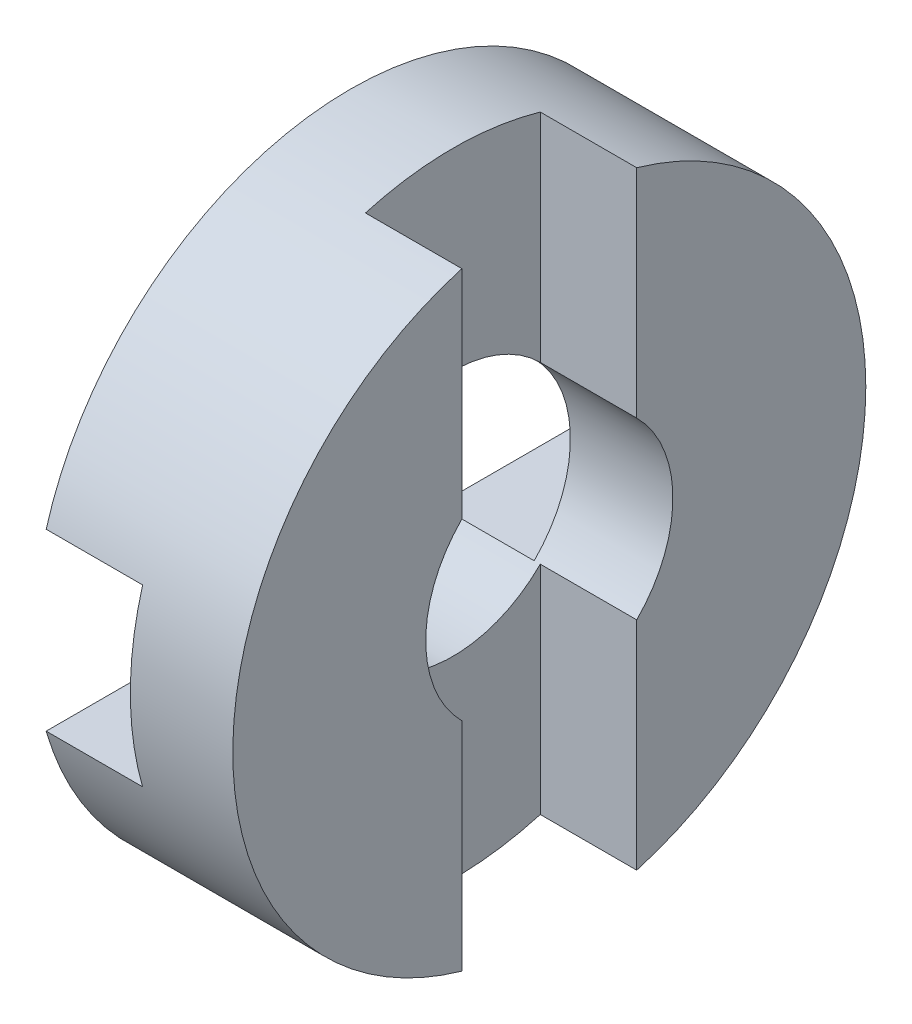
ISO-10303-21;
HEADER;
FILE_DESCRIPTION(('STEP AP214'),'2;1');
FILE_NAME('part.step','',(''),(''),'','','');
FILE_SCHEMA(('AUTOMOTIVE_DESIGN { 1 0 10303 214 1 1 1 1 }'));
ENDSEC;
DATA;
#1=APPLICATION_CONTEXT('core data for automotive mechanical design processes');
#2=APPLICATION_PROTOCOL_DEFINITION('international standard','automotive_design',2000,#1);
#3=PRODUCT_CONTEXT('',#1,'mechanical');
#4=PRODUCT('Part','Part','',(#3));
#5=PRODUCT_RELATED_PRODUCT_CATEGORY('part','',(#4));
#6=PRODUCT_DEFINITION_FORMATION('','',#4);
#7=PRODUCT_DEFINITION_CONTEXT('part definition',#1,'design');
#8=PRODUCT_DEFINITION('design','',#6,#7);
#9=PRODUCT_DEFINITION_SHAPE('','',#8);
#10=(LENGTH_UNIT() NAMED_UNIT(*) SI_UNIT(.MILLI.,.METRE.));
#11=(NAMED_UNIT(*) PLANE_ANGLE_UNIT() SI_UNIT($,.RADIAN.));
#12=(NAMED_UNIT(*) SI_UNIT($,.STERADIAN.) SOLID_ANGLE_UNIT());
#13=UNCERTAINTY_MEASURE_WITH_UNIT(LENGTH_MEASURE(1.E-05),#10,'distance_accuracy_value','');
#14=(GEOMETRIC_REPRESENTATION_CONTEXT(3) GLOBAL_UNCERTAINTY_ASSIGNED_CONTEXT((#13)) GLOBAL_UNIT_ASSIGNED_CONTEXT((#10,
#11,#12)) REPRESENTATION_CONTEXT('',''));
#15=CARTESIAN_POINT('',(0.,0.,0.));
#16=DIRECTION('',(0.,0.,1.));
#17=DIRECTION('',(1.,0.,0.));
#18=AXIS2_PLACEMENT_3D('',#15,#16,#17);
#19=CARTESIAN_POINT('',(-3.3,0.,-7.3));
#20=DIRECTION('',(-1.,0.,0.));
#21=DIRECTION('',(0.,0.,1.));
#22=AXIS2_PLACEMENT_3D('',#19,#20,#21);
#23=PLANE('',#22);
#24=DIRECTION('',(0.,0.,1.));
#25=VECTOR('',#24,1.);
#26=CARTESIAN_POINT('',(-3.3,2.9,-10.5));
#27=LINE('',#26,#25);
#28=CARTESIAN_POINT('',(-3.3,2.9,-10.0915806492343));
#29=VERTEX_POINT('',#28);
#30=CARTESIAN_POINT('',(-3.3,2.9,-2.89827534923789));
#31=VERTEX_POINT('',#30);
#32=EDGE_CURVE('E127',#29,#31,#27,.T.);
#33=ORIENTED_EDGE('',*,*,#32,.T.);
#34=CARTESIAN_POINT('',(-3.3,0.,0.));
#35=DIRECTION('',(-1.,0.,0.));
#36=DIRECTION('',(0.,0.,1.));
#37=AXIS2_PLACEMENT_3D('',#34,#35,#36);
#38=CIRCLE('',#37,4.1);
#39=CARTESIAN_POINT('',(-3.3,2.9,2.89827534923789));
#40=VERTEX_POINT('',#39);
#41=EDGE_CURVE('E20',#31,#40,#38,.F.);
#42=ORIENTED_EDGE('',*,*,#41,.T.);
#43=DIRECTION('',(0.,0.,1.));
#44=VECTOR('',#43,1.);
#45=CARTESIAN_POINT('',(-3.3,2.9,-10.5));
#46=LINE('',#45,#44);
#47=CARTESIAN_POINT('',(-3.3,2.9,10.0915806492343));
#48=VERTEX_POINT('',#47);
#49=EDGE_CURVE('E131',#40,#48,#46,.T.);
#50=ORIENTED_EDGE('',*,*,#49,.T.);
#51=CARTESIAN_POINT('',(-3.3,0.,0.));
#52=DIRECTION('',(-1.,0.,0.));
#53=DIRECTION('',(0.,0.,1.));
#54=AXIS2_PLACEMENT_3D('',#51,#52,#53);
#55=CIRCLE('',#54,10.5);
#56=EDGE_CURVE('E211',#29,#48,#55,.F.);
#57=ORIENTED_EDGE('',*,*,#56,.F.);
#58=EDGE_LOOP('',(#33,#42,#50,#57));
#59=FACE_BOUND('',#58,.T.);
#60=ADVANCED_FACE('F17',(#59),#23,.T.);
#61=CARTESIAN_POINT('',(3.3,-10.5,2.9));
#62=DIRECTION('',(0.,0.,1.));
#63=DIRECTION('',(1.,0.,0.));
#64=AXIS2_PLACEMENT_3D('',#61,#62,#63);
#65=PLANE('',#64);
#66=DIRECTION('',(0.,1.,0.));
#67=VECTOR('',#66,1.);
#68=CARTESIAN_POINT('',(0.0999999999999996,-10.5,2.9));
#69=LINE('',#68,#67);
#70=CARTESIAN_POINT('',(0.0999999999999996,2.89827534923789,2.9));
#71=VERTEX_POINT('',#70);
#72=CARTESIAN_POINT('',(0.0999999999999996,10.0915806492343,2.9));
#73=VERTEX_POINT('',#72);
#74=EDGE_CURVE('E163',#71,#73,#69,.T.);
#75=ORIENTED_EDGE('',*,*,#74,.T.);
#76=DIRECTION('',(-1.,0.,0.));
#77=VECTOR('',#76,1.);
#78=CARTESIAN_POINT('',(0.,10.0915806492343,2.9));
#79=LINE('',#78,#77);
#80=CARTESIAN_POINT('',(3.3,10.0915806492343,2.9));
#81=VERTEX_POINT('',#80);
#82=EDGE_CURVE('E165',#81,#73,#79,.T.);
#83=ORIENTED_EDGE('',*,*,#82,.F.);
#84=DIRECTION('',(0.,1.,0.));
#85=VECTOR('',#84,1.);
#86=CARTESIAN_POINT('',(3.3,0.,2.9));
#87=LINE('',#86,#85);
#88=CARTESIAN_POINT('',(3.3,2.89827534923789,2.9));
#89=VERTEX_POINT('',#88);
#90=EDGE_CURVE('E172',#89,#81,#87,.T.);
#91=ORIENTED_EDGE('',*,*,#90,.F.);
#92=DIRECTION('',(-1.,0.,0.));
#93=VECTOR('',#92,1.);
#94=CARTESIAN_POINT('',(0.,2.89827534923789,2.9));
#95=LINE('',#94,#93);
#96=EDGE_CURVE('E151',#89,#71,#95,.T.);
#97=ORIENTED_EDGE('',*,*,#96,.T.);
#98=EDGE_LOOP('',(#75,#83,#91,#97));
#99=FACE_BOUND('',#98,.T.);
#100=ADVANCED_FACE('F284',(#99),#65,.F.);
#101=CARTESIAN_POINT('',(0.0999999999999996,-10.5,2.9));
#102=DIRECTION('',(-1.,0.,0.));
#103=DIRECTION('',(0.,0.,1.));
#104=AXIS2_PLACEMENT_3D('',#101,#102,#103);
#105=PLANE('',#104);
#106=DIRECTION('',(0.,1.,0.));
#107=VECTOR('',#106,1.);
#108=CARTESIAN_POINT('',(0.0999999999999996,-10.5,-2.9));
#109=LINE('',#108,#107);
#110=CARTESIAN_POINT('',(0.0999999999999996,2.89827534923789,-2.9));
#111=VERTEX_POINT('',#110);
#112=CARTESIAN_POINT('',(0.0999999999999996,10.0915806492343,-2.9));
#113=VERTEX_POINT('',#112);
#114=EDGE_CURVE('E145',#111,#113,#109,.T.);
#115=ORIENTED_EDGE('',*,*,#114,.T.);
#116=CARTESIAN_POINT('',(0.0999999999999996,0.,0.));
#117=DIRECTION('',(-1.,0.,0.));
#118=DIRECTION('',(0.,0.,1.));
#119=AXIS2_PLACEMENT_3D('',#116,#117,#118);
#120=CIRCLE('',#119,10.5);
#121=EDGE_CURVE('E161',#73,#113,#120,.T.);
#122=ORIENTED_EDGE('',*,*,#121,.F.);
#123=ORIENTED_EDGE('',*,*,#74,.F.);
#124=CARTESIAN_POINT('',(0.0999999999999996,0.,0.));
#125=DIRECTION('',(-1.,0.,0.));
#126=DIRECTION('',(0.,0.,1.));
#127=AXIS2_PLACEMENT_3D('',#124,#125,#126);
#128=CIRCLE('',#127,4.1);
#129=EDGE_CURVE('E153',#71,#111,#128,.T.);
#130=ORIENTED_EDGE('',*,*,#129,.T.);
#131=EDGE_LOOP('',(#115,#122,#123,#130));
#132=FACE_BOUND('',#131,.T.);
#133=ADVANCED_FACE('F226',(#132),#105,.F.);
#134=CARTESIAN_POINT('',(0.0999999999999996,-10.5,-2.9));
#135=DIRECTION('',(0.,0.,-1.));
#136=DIRECTION('',(-1.,0.,0.));
#137=AXIS2_PLACEMENT_3D('',#134,#135,#136);
#138=PLANE('',#137);
#139=DIRECTION('',(0.,1.,0.));
#140=VECTOR('',#139,1.);
#141=CARTESIAN_POINT('',(3.3,0.,-2.9));
#142=LINE('',#141,#140);
#143=CARTESIAN_POINT('',(3.3,10.0915806492343,-2.9));
#144=VERTEX_POINT('',#143);
#145=CARTESIAN_POINT('',(3.3,2.89827534923789,-2.9));
#146=VERTEX_POINT('',#145);
#147=EDGE_CURVE('E181',#144,#146,#142,.F.);
#148=ORIENTED_EDGE('',*,*,#147,.F.);
#149=DIRECTION('',(-1.,0.,0.));
#150=VECTOR('',#149,1.);
#151=CARTESIAN_POINT('',(0.,10.0915806492343,-2.9));
#152=LINE('',#151,#150);
#153=EDGE_CURVE('E158',#113,#144,#152,.F.);
#154=ORIENTED_EDGE('',*,*,#153,.F.);
#155=ORIENTED_EDGE('',*,*,#114,.F.);
#156=DIRECTION('',(-1.,0.,0.));
#157=VECTOR('',#156,1.);
#158=CARTESIAN_POINT('',(0.,2.89827534923789,-2.9));
#159=LINE('',#158,#157);
#160=EDGE_CURVE('E179',#111,#146,#159,.F.);
#161=ORIENTED_EDGE('',*,*,#160,.T.);
#162=EDGE_LOOP('',(#148,#154,#155,#161));
#163=FACE_BOUND('',#162,.T.);
#164=ADVANCED_FACE('F234',(#163),#138,.F.);
#165=CARTESIAN_POINT('',(-3.3,2.9,-10.5));
#166=DIRECTION('',(0.,1.,0.));
#167=DIRECTION('',(0.,0.,1.));
#168=AXIS2_PLACEMENT_3D('',#165,#166,#167);
#169=PLANE('',#168);
#170=ORIENTED_EDGE('',*,*,#49,.F.);
#171=DIRECTION('',(-1.,0.,0.));
#172=VECTOR('',#171,1.);
#173=CARTESIAN_POINT('',(0.,2.9,2.89827534923789));
#174=LINE('',#173,#172);
#175=CARTESIAN_POINT('',(-0.0999999999999996,2.9,2.89827534923789));
#176=VERTEX_POINT('',#175);
#177=EDGE_CURVE('E136',#40,#176,#174,.F.);
#178=ORIENTED_EDGE('',*,*,#177,.T.);
#179=DIRECTION('',(0.,0.,-1.));
#180=VECTOR('',#179,1.);
#181=CARTESIAN_POINT('',(-0.0999999999999996,2.9,-10.5));
#182=LINE('',#181,#180);
#183=CARTESIAN_POINT('',(-0.0999999999999996,2.9,10.0915806492343));
#184=VERTEX_POINT('',#183);
#185=EDGE_CURVE('E208',#176,#184,#182,.F.);
#186=ORIENTED_EDGE('',*,*,#185,.T.);
#187=DIRECTION('',(-1.,0.,0.));
#188=VECTOR('',#187,1.);
#189=CARTESIAN_POINT('',(0.,2.9,10.0915806492343));
#190=LINE('',#189,#188);
#191=EDGE_CURVE('E143',#48,#184,#190,.F.);
#192=ORIENTED_EDGE('',*,*,#191,.F.);
#193=EDGE_LOOP('',(#170,#178,#186,#192));
#194=FACE_BOUND('',#193,.T.);
#195=ADVANCED_FACE('F139',(#194),#169,.F.);
#196=CARTESIAN_POINT('',(-3.3,2.9,-10.5));
#197=DIRECTION('',(0.,1.,0.));
#198=DIRECTION('',(0.,0.,1.));
#199=AXIS2_PLACEMENT_3D('',#196,#197,#198);
#200=PLANE('',#199);
#201=ORIENTED_EDGE('',*,*,#32,.F.);
#202=DIRECTION('',(-1.,0.,0.));
#203=VECTOR('',#202,1.);
#204=CARTESIAN_POINT('',(0.,2.9,-10.0915806492343));
#205=LINE('',#204,#203);
#206=CARTESIAN_POINT('',(-0.0999999999999996,2.9,-10.0915806492343));
#207=VERTEX_POINT('',#206);
#208=EDGE_CURVE('E213',#207,#29,#205,.T.);
#209=ORIENTED_EDGE('',*,*,#208,.F.);
#210=DIRECTION('',(0.,0.,-1.));
#211=VECTOR('',#210,1.);
#212=CARTESIAN_POINT('',(-0.0999999999999996,2.9,-10.5));
#213=LINE('',#212,#211);
#214=CARTESIAN_POINT('',(-0.0999999999999996,2.9,-2.89827534923789));
#215=VERTEX_POINT('',#214);
#216=EDGE_CURVE('E202',#207,#215,#213,.F.);
#217=ORIENTED_EDGE('',*,*,#216,.T.);
#218=DIRECTION('',(-1.,0.,0.));
#219=VECTOR('',#218,1.);
#220=CARTESIAN_POINT('',(0.,2.9,-2.89827534923789));
#221=LINE('',#220,#219);
#222=EDGE_CURVE('E137',#215,#31,#221,.T.);
#223=ORIENTED_EDGE('',*,*,#222,.T.);
#224=EDGE_LOOP('',(#201,#209,#217,#223));
#225=FACE_BOUND('',#224,.T.);
#226=ADVANCED_FACE('F328',(#225),#200,.F.);
#227=CARTESIAN_POINT('',(0.,0.,0.));
#228=DIRECTION('',(-1.,0.,0.));
#229=DIRECTION('',(0.,0.,1.));
#230=AXIS2_PLACEMENT_3D('',#227,#228,#229);
#231=CYLINDRICAL_SURFACE('',#230,4.1);
#232=CARTESIAN_POINT('',(3.3,0.,0.));
#233=DIRECTION('',(-1.,0.,0.));
#234=DIRECTION('',(0.,0.,1.));
#235=AXIS2_PLACEMENT_3D('',#232,#233,#234);
#236=CIRCLE('',#235,4.1);
#237=CARTESIAN_POINT('',(3.3,-2.89827534923789,2.9));
#238=VERTEX_POINT('',#237);
#239=EDGE_CURVE('E214',#238,#89,#236,.T.);
#240=ORIENTED_EDGE('',*,*,#239,.F.);
#241=DIRECTION('',(1.,0.,0.));
#242=VECTOR('',#241,1.);
#243=CARTESIAN_POINT('',(3.3,-2.89827534923789,2.9));
#244=LINE('',#243,#242);
#245=CARTESIAN_POINT('',(0.0999999999999995,-2.89827534923789,2.9));
#246=VERTEX_POINT('',#245);
#247=EDGE_CURVE('E169',#238,#246,#244,.F.);
#248=ORIENTED_EDGE('',*,*,#247,.T.);
#249=CARTESIAN_POINT('',(0.0999999999999996,0.,0.));
#250=DIRECTION('',(-1.,0.,0.));
#251=DIRECTION('',(0.,0.,1.));
#252=AXIS2_PLACEMENT_3D('',#249,#250,#251);
#253=CIRCLE('',#252,4.1);
#254=CARTESIAN_POINT('',(0.0999999999999996,-2.89827534923789,-2.9));
#255=VERTEX_POINT('',#254);
#256=EDGE_CURVE('E218',#246,#255,#253,.F.);
#257=ORIENTED_EDGE('',*,*,#256,.T.);
#258=DIRECTION('',(-1.,0.,0.));
#259=VECTOR('',#258,1.);
#260=CARTESIAN_POINT('',(0.0999999999999996,-2.89827534923789,-2.9));
#261=LINE('',#260,#259);
#262=CARTESIAN_POINT('',(3.3,-2.89827534923789,-2.9));
#263=VERTEX_POINT('',#262);
#264=EDGE_CURVE('E174',#255,#263,#261,.F.);
#265=ORIENTED_EDGE('',*,*,#264,.T.);
#266=CARTESIAN_POINT('',(3.3,0.,0.));
#267=DIRECTION('',(-1.,0.,0.));
#268=DIRECTION('',(0.,0.,1.));
#269=AXIS2_PLACEMENT_3D('',#266,#267,#268);
#270=CIRCLE('',#269,4.1);
#271=EDGE_CURVE('E221',#146,#263,#270,.T.);
#272=ORIENTED_EDGE('',*,*,#271,.F.);
#273=ORIENTED_EDGE('',*,*,#160,.F.);
#274=ORIENTED_EDGE('',*,*,#129,.F.);
#275=ORIENTED_EDGE('',*,*,#96,.F.);
#276=EDGE_LOOP('',(#240,#248,#257,#265,#272,#273,#274,#275));
#277=FACE_BOUND('',#276,.T.);
#278=DIRECTION('',(1.,0.,0.));
#279=VECTOR('',#278,1.);
#280=CARTESIAN_POINT('',(-0.0999999999999996,-2.9,2.89827534923789));
#281=LINE('',#280,#279);
#282=CARTESIAN_POINT('',(-3.3,-2.9,2.89827534923789));
#283=VERTEX_POINT('',#282);
#284=CARTESIAN_POINT('',(-0.0999999999999996,-2.9,2.89827534923789));
#285=VERTEX_POINT('',#284);
#286=EDGE_CURVE('E249',#283,#285,#281,.T.);
#287=ORIENTED_EDGE('',*,*,#286,.T.);
#288=CARTESIAN_POINT('',(-0.0999999999999996,0.,0.));
#289=DIRECTION('',(-1.,0.,0.));
#290=DIRECTION('',(0.,0.,1.));
#291=AXIS2_PLACEMENT_3D('',#288,#289,#290);
#292=CIRCLE('',#291,4.1);
#293=EDGE_CURVE('E149',#285,#176,#292,.T.);
#294=ORIENTED_EDGE('',*,*,#293,.T.);
#295=ORIENTED_EDGE('',*,*,#177,.F.);
#296=ORIENTED_EDGE('',*,*,#41,.F.);
#297=ORIENTED_EDGE('',*,*,#222,.F.);
#298=CARTESIAN_POINT('',(-0.0999999999999996,0.,0.));
#299=DIRECTION('',(-1.,0.,0.));
#300=DIRECTION('',(0.,0.,1.));
#301=AXIS2_PLACEMENT_3D('',#298,#299,#300);
#302=CIRCLE('',#301,4.1);
#303=CARTESIAN_POINT('',(-0.0999999999999996,-2.9,-2.89827534923789));
#304=VERTEX_POINT('',#303);
#305=EDGE_CURVE('E200',#215,#304,#302,.T.);
#306=ORIENTED_EDGE('',*,*,#305,.T.);
#307=DIRECTION('',(1.,0.,0.));
#308=VECTOR('',#307,1.);
#309=CARTESIAN_POINT('',(-0.0999999999999996,-2.9,-2.89827534923789));
#310=LINE('',#309,#308);
#311=CARTESIAN_POINT('',(-3.3,-2.9,-2.89827534923789));
#312=VERTEX_POINT('',#311);
#313=EDGE_CURVE('E247',#304,#312,#310,.F.);
#314=ORIENTED_EDGE('',*,*,#313,.T.);
#315=CARTESIAN_POINT('',(-3.3,0.,0.));
#316=DIRECTION('',(-1.,0.,0.));
#317=DIRECTION('',(0.,0.,1.));
#318=AXIS2_PLACEMENT_3D('',#315,#316,#317);
#319=CIRCLE('',#318,4.1);
#320=EDGE_CURVE('E203',#283,#312,#319,.F.);
#321=ORIENTED_EDGE('',*,*,#320,.F.);
#322=EDGE_LOOP('',(#287,#294,#295,#296,#297,#306,#314,#321));
#323=FACE_BOUND('',#322,.T.);
#324=ADVANCED_FACE('F148',(#277,#323),#231,.F.);
#325=CARTESIAN_POINT('',(3.3,0.,-7.3));
#326=DIRECTION('',(1.,0.,0.));
#327=DIRECTION('',(0.,0.,-1.));
#328=AXIS2_PLACEMENT_3D('',#325,#326,#327);
#329=PLANE('',#328);
#330=CARTESIAN_POINT('',(3.3,0.,0.));
#331=DIRECTION('',(-1.,0.,0.));
#332=DIRECTION('',(0.,0.,1.));
#333=AXIS2_PLACEMENT_3D('',#330,#331,#332);
#334=CIRCLE('',#333,10.5);
#335=CARTESIAN_POINT('',(3.3,-10.0915806492343,-2.9));
#336=VERTEX_POINT('',#335);
#337=EDGE_CURVE('E197',#144,#336,#334,.T.);
#338=ORIENTED_EDGE('',*,*,#337,.F.);
#339=ORIENTED_EDGE('',*,*,#147,.T.);
#340=ORIENTED_EDGE('',*,*,#271,.T.);
#341=DIRECTION('',(0.,1.,0.));
#342=VECTOR('',#341,1.);
#343=CARTESIAN_POINT('',(3.3,-10.5,-2.9));
#344=LINE('',#343,#342);
#345=EDGE_CURVE('E178',#263,#336,#344,.F.);
#346=ORIENTED_EDGE('',*,*,#345,.T.);
#347=EDGE_LOOP('',(#338,#339,#340,#346));
#348=FACE_BOUND('',#347,.T.);
#349=ADVANCED_FACE('F238',(#348),#329,.T.);
#350=CARTESIAN_POINT('',(0.0999999999999996,-10.5,-2.9));
#351=DIRECTION('',(0.,0.,-1.));
#352=DIRECTION('',(-1.,0.,0.));
#353=AXIS2_PLACEMENT_3D('',#350,#351,#352);
#354=PLANE('',#353);
#355=DIRECTION('',(0.,1.,0.));
#356=VECTOR('',#355,1.);
#357=CARTESIAN_POINT('',(0.0999999999999996,-10.5,-2.9));
#358=LINE('',#357,#356);
#359=CARTESIAN_POINT('',(0.0999999999999996,-10.0915806492343,-2.9));
#360=VERTEX_POINT('',#359);
#361=EDGE_CURVE('E177',#255,#360,#358,.F.);
#362=ORIENTED_EDGE('',*,*,#361,.T.);
#363=DIRECTION('',(-1.,0.,0.));
#364=VECTOR('',#363,1.);
#365=CARTESIAN_POINT('',(0.,-10.0915806492343,-2.9));
#366=LINE('',#365,#364);
#367=EDGE_CURVE('E196',#336,#360,#366,.T.);
#368=ORIENTED_EDGE('',*,*,#367,.F.);
#369=ORIENTED_EDGE('',*,*,#345,.F.);
#370=ORIENTED_EDGE('',*,*,#264,.F.);
#371=EDGE_LOOP('',(#362,#368,#369,#370));
#372=FACE_BOUND('',#371,.T.);
#373=ADVANCED_FACE('F270',(#372),#354,.F.);
#374=CARTESIAN_POINT('',(0.0999999999999996,-10.5,2.9));
#375=DIRECTION('',(-1.,0.,0.));
#376=DIRECTION('',(0.,0.,1.));
#377=AXIS2_PLACEMENT_3D('',#374,#375,#376);
#378=PLANE('',#377);
#379=DIRECTION('',(0.,1.,0.));
#380=VECTOR('',#379,1.);
#381=CARTESIAN_POINT('',(0.0999999999999994,-10.5,2.9));
#382=LINE('',#381,#380);
#383=CARTESIAN_POINT('',(0.0999999999999996,-10.0915806492343,2.9));
#384=VERTEX_POINT('',#383);
#385=EDGE_CURVE('E173',#246,#384,#382,.F.);
#386=ORIENTED_EDGE('',*,*,#385,.T.);
#387=CARTESIAN_POINT('',(0.0999999999999996,0.,0.));
#388=DIRECTION('',(-1.,0.,0.));
#389=DIRECTION('',(0.,0.,1.));
#390=AXIS2_PLACEMENT_3D('',#387,#388,#389);
#391=CIRCLE('',#390,10.5);
#392=EDGE_CURVE('E193',#360,#384,#391,.T.);
#393=ORIENTED_EDGE('',*,*,#392,.F.);
#394=ORIENTED_EDGE('',*,*,#361,.F.);
#395=ORIENTED_EDGE('',*,*,#256,.F.);
#396=EDGE_LOOP('',(#386,#393,#394,#395));
#397=FACE_BOUND('',#396,.T.);
#398=ADVANCED_FACE('F273',(#397),#378,.F.);
#399=CARTESIAN_POINT('',(3.3,-10.5,2.9));
#400=DIRECTION('',(0.,0.,1.));
#401=DIRECTION('',(1.,0.,0.));
#402=AXIS2_PLACEMENT_3D('',#399,#400,#401);
#403=PLANE('',#402);
#404=DIRECTION('',(0.,1.,0.));
#405=VECTOR('',#404,1.);
#406=CARTESIAN_POINT('',(3.3,0.,2.9));
#407=LINE('',#406,#405);
#408=CARTESIAN_POINT('',(3.3,-10.0915806492343,2.9));
#409=VERTEX_POINT('',#408);
#410=EDGE_CURVE('E217',#409,#238,#407,.T.);
#411=ORIENTED_EDGE('',*,*,#410,.F.);
#412=DIRECTION('',(-1.,0.,0.));
#413=VECTOR('',#412,1.);
#414=CARTESIAN_POINT('',(0.,-10.0915806492343,2.89999999999999));
#415=LINE('',#414,#413);
#416=EDGE_CURVE('E192',#384,#409,#415,.F.);
#417=ORIENTED_EDGE('',*,*,#416,.F.);
#418=ORIENTED_EDGE('',*,*,#385,.F.);
#419=ORIENTED_EDGE('',*,*,#247,.F.);
#420=EDGE_LOOP('',(#411,#417,#418,#419));
#421=FACE_BOUND('',#420,.T.);
#422=ADVANCED_FACE('F278',(#421),#403,.F.);
#423=CARTESIAN_POINT('',(3.3,0.,-7.3));
#424=DIRECTION('',(1.,0.,0.));
#425=DIRECTION('',(0.,0.,-1.));
#426=AXIS2_PLACEMENT_3D('',#423,#424,#425);
#427=PLANE('',#426);
#428=ORIENTED_EDGE('',*,*,#410,.T.);
#429=ORIENTED_EDGE('',*,*,#239,.T.);
#430=ORIENTED_EDGE('',*,*,#90,.T.);
#431=CARTESIAN_POINT('',(3.3,0.,0.));
#432=DIRECTION('',(-1.,0.,0.));
#433=DIRECTION('',(0.,0.,1.));
#434=AXIS2_PLACEMENT_3D('',#431,#432,#433);
#435=CIRCLE('',#434,10.5);
#436=EDGE_CURVE('E190',#409,#81,#435,.T.);
#437=ORIENTED_EDGE('',*,*,#436,.F.);
#438=EDGE_LOOP('',(#428,#429,#430,#437));
#439=FACE_BOUND('',#438,.T.);
#440=ADVANCED_FACE('F282',(#439),#427,.T.);
#441=CARTESIAN_POINT('',(-0.0999999999999996,2.9,-10.5));
#442=DIRECTION('',(1.,0.,0.));
#443=DIRECTION('',(0.,0.,-1.));
#444=AXIS2_PLACEMENT_3D('',#441,#442,#443);
#445=PLANE('',#444);
#446=ORIENTED_EDGE('',*,*,#185,.F.);
#447=ORIENTED_EDGE('',*,*,#293,.F.);
#448=DIRECTION('',(0.,0.,-1.));
#449=VECTOR('',#448,1.);
#450=CARTESIAN_POINT('',(-0.0999999999999996,-2.9,-10.5));
#451=LINE('',#450,#449);
#452=CARTESIAN_POINT('',(-0.0999999999999996,-2.9,10.0915806492343));
#453=VERTEX_POINT('',#452);
#454=EDGE_CURVE('E250',#285,#453,#451,.F.);
#455=ORIENTED_EDGE('',*,*,#454,.T.);
#456=CARTESIAN_POINT('',(-0.0999999999999996,0.,0.));
#457=DIRECTION('',(-1.,0.,0.));
#458=DIRECTION('',(0.,0.,1.));
#459=AXIS2_PLACEMENT_3D('',#456,#457,#458);
#460=CIRCLE('',#459,10.5);
#461=EDGE_CURVE('E187',#184,#453,#460,.F.);
#462=ORIENTED_EDGE('',*,*,#461,.F.);
#463=EDGE_LOOP('',(#446,#447,#455,#462));
#464=FACE_BOUND('',#463,.T.);
#465=ADVANCED_FACE('F311',(#464),#445,.F.);
#466=CARTESIAN_POINT('',(-0.0999999999999996,-2.9,-10.5));
#467=DIRECTION('',(0.,-1.,0.));
#468=DIRECTION('',(0.,0.,-1.));
#469=AXIS2_PLACEMENT_3D('',#466,#467,#468);
#470=PLANE('',#469);
#471=ORIENTED_EDGE('',*,*,#454,.F.);
#472=ORIENTED_EDGE('',*,*,#286,.F.);
#473=DIRECTION('',(0.,0.,1.));
#474=VECTOR('',#473,1.);
#475=CARTESIAN_POINT('',(-3.3,-2.9,-7.3));
#476=LINE('',#475,#474);
#477=CARTESIAN_POINT('',(-3.3,-2.9,10.0915806492343));
#478=VERTEX_POINT('',#477);
#479=EDGE_CURVE('E206',#478,#283,#476,.F.);
#480=ORIENTED_EDGE('',*,*,#479,.F.);
#481=DIRECTION('',(-1.,0.,0.));
#482=VECTOR('',#481,1.);
#483=CARTESIAN_POINT('',(0.,-2.9,10.0915806492343));
#484=LINE('',#483,#482);
#485=EDGE_CURVE('E186',#453,#478,#484,.T.);
#486=ORIENTED_EDGE('',*,*,#485,.F.);
#487=EDGE_LOOP('',(#471,#472,#480,#486));
#488=FACE_BOUND('',#487,.T.);
#489=ADVANCED_FACE('F307',(#488),#470,.F.);
#490=CARTESIAN_POINT('',(-3.3,0.,-7.3));
#491=DIRECTION('',(-1.,0.,0.));
#492=DIRECTION('',(0.,0.,1.));
#493=AXIS2_PLACEMENT_3D('',#490,#491,#492);
#494=PLANE('',#493);
#495=DIRECTION('',(0.,0.,-1.));
#496=VECTOR('',#495,1.);
#497=CARTESIAN_POINT('',(-3.3,-2.9,-10.5));
#498=LINE('',#497,#496);
#499=CARTESIAN_POINT('',(-3.3,-2.9,-10.0915806492343));
#500=VERTEX_POINT('',#499);
#501=EDGE_CURVE('E205',#312,#500,#498,.T.);
#502=ORIENTED_EDGE('',*,*,#501,.T.);
#503=CARTESIAN_POINT('',(-3.3,0.,0.));
#504=DIRECTION('',(-1.,0.,0.));
#505=DIRECTION('',(0.,0.,1.));
#506=AXIS2_PLACEMENT_3D('',#503,#504,#505);
#507=CIRCLE('',#506,10.5);
#508=EDGE_CURVE('E183',#478,#500,#507,.F.);
#509=ORIENTED_EDGE('',*,*,#508,.F.);
#510=ORIENTED_EDGE('',*,*,#479,.T.);
#511=ORIENTED_EDGE('',*,*,#320,.T.);
#512=EDGE_LOOP('',(#502,#509,#510,#511));
#513=FACE_BOUND('',#512,.T.);
#514=ADVANCED_FACE('F304',(#513),#494,.T.);
#515=CARTESIAN_POINT('',(-0.0999999999999996,-2.9,-10.5));
#516=DIRECTION('',(0.,-1.,0.));
#517=DIRECTION('',(0.,0.,-1.));
#518=AXIS2_PLACEMENT_3D('',#515,#516,#517);
#519=PLANE('',#518);
#520=DIRECTION('',(0.,0.,-1.));
#521=VECTOR('',#520,1.);
#522=CARTESIAN_POINT('',(-0.0999999999999996,-2.9,-10.5));
#523=LINE('',#522,#521);
#524=CARTESIAN_POINT('',(-0.0999999999999996,-2.9,-10.0915806492343));
#525=VERTEX_POINT('',#524);
#526=EDGE_CURVE('E35',#304,#525,#523,.T.);
#527=ORIENTED_EDGE('',*,*,#526,.T.);
#528=DIRECTION('',(-1.,0.,0.));
#529=VECTOR('',#528,1.);
#530=CARTESIAN_POINT('',(0.,-2.89999999999999,-10.0915806492343));
#531=LINE('',#530,#529);
#532=EDGE_CURVE('E26',#500,#525,#531,.F.);
#533=ORIENTED_EDGE('',*,*,#532,.F.);
#534=ORIENTED_EDGE('',*,*,#501,.F.);
#535=ORIENTED_EDGE('',*,*,#313,.F.);
#536=EDGE_LOOP('',(#527,#533,#534,#535));
#537=FACE_BOUND('',#536,.T.);
#538=ADVANCED_FACE('F298',(#537),#519,.F.);
#539=CARTESIAN_POINT('',(-0.0999999999999996,2.9,-10.5));
#540=DIRECTION('',(1.,0.,0.));
#541=DIRECTION('',(0.,0.,-1.));
#542=AXIS2_PLACEMENT_3D('',#539,#540,#541);
#543=PLANE('',#542);
#544=ORIENTED_EDGE('',*,*,#216,.F.);
#545=CARTESIAN_POINT('',(-0.0999999999999996,0.,0.));
#546=DIRECTION('',(-1.,0.,0.));
#547=DIRECTION('',(0.,0.,1.));
#548=AXIS2_PLACEMENT_3D('',#545,#546,#547);
#549=CIRCLE('',#548,10.5);
#550=EDGE_CURVE('E11',#525,#207,#549,.F.);
#551=ORIENTED_EDGE('',*,*,#550,.F.);
#552=ORIENTED_EDGE('',*,*,#526,.F.);
#553=ORIENTED_EDGE('',*,*,#305,.F.);
#554=EDGE_LOOP('',(#544,#551,#552,#553));
#555=FACE_BOUND('',#554,.T.);
#556=ADVANCED_FACE('F293',(#555),#543,.F.);
#557=CARTESIAN_POINT('',(0.,0.,0.));
#558=DIRECTION('',(-1.,0.,0.));
#559=DIRECTION('',(0.,0.,1.));
#560=AXIS2_PLACEMENT_3D('',#557,#558,#559);
#561=CYLINDRICAL_SURFACE('',#560,10.5);
#562=ORIENTED_EDGE('',*,*,#153,.T.);
#563=ORIENTED_EDGE('',*,*,#337,.T.);
#564=ORIENTED_EDGE('',*,*,#367,.T.);
#565=ORIENTED_EDGE('',*,*,#392,.T.);
#566=ORIENTED_EDGE('',*,*,#416,.T.);
#567=ORIENTED_EDGE('',*,*,#436,.T.);
#568=ORIENTED_EDGE('',*,*,#82,.T.);
#569=ORIENTED_EDGE('',*,*,#121,.T.);
#570=EDGE_LOOP('',(#562,#563,#564,#565,#566,#567,#568,#569));
#571=FACE_BOUND('',#570,.T.);
#572=ORIENTED_EDGE('',*,*,#532,.T.);
#573=ORIENTED_EDGE('',*,*,#550,.T.);
#574=ORIENTED_EDGE('',*,*,#208,.T.);
#575=ORIENTED_EDGE('',*,*,#56,.T.);
#576=ORIENTED_EDGE('',*,*,#191,.T.);
#577=ORIENTED_EDGE('',*,*,#461,.T.);
#578=ORIENTED_EDGE('',*,*,#485,.T.);
#579=ORIENTED_EDGE('',*,*,#508,.T.);
#580=EDGE_LOOP('',(#572,#573,#574,#575,#576,#577,#578,#579));
#581=FACE_BOUND('',#580,.T.);
#582=ADVANCED_FACE('F266',(#571,#581),#561,.T.);
#583=CLOSED_SHELL('',(#60,#100,#133,#164,#195,#226,#324,#349,#373,#398,#422,#440,#465,#489,#514,
#538,#556,#582));
#584=MANIFOLD_SOLID_BREP('B1',#583);
#585=ADVANCED_BREP_SHAPE_REPRESENTATION('',(#18,#584),#14);
#586=SHAPE_DEFINITION_REPRESENTATION(#9,#585);
ENDSEC;
END-ISO-10303-21;
